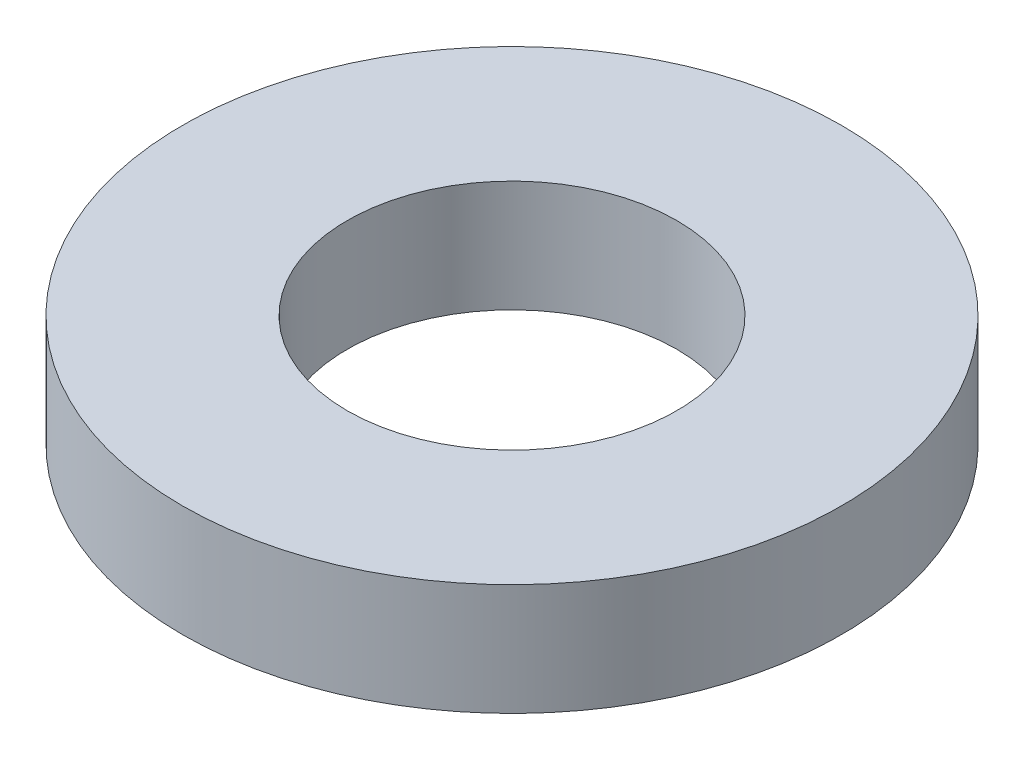
ISO-10303-21;
HEADER;
FILE_DESCRIPTION(('STEP AP214'),'2;1');
FILE_NAME('part.step','',(''),(''),'','','');
FILE_SCHEMA(('AUTOMOTIVE_DESIGN { 1 0 10303 214 1 1 1 1 }'));
ENDSEC;
DATA;
#1=APPLICATION_CONTEXT('core data for automotive mechanical design processes');
#2=APPLICATION_PROTOCOL_DEFINITION('international standard','automotive_design',2000,#1);
#3=PRODUCT_CONTEXT('',#1,'mechanical');
#4=PRODUCT('Part','Part','',(#3));
#5=PRODUCT_RELATED_PRODUCT_CATEGORY('part','',(#4));
#6=PRODUCT_DEFINITION_FORMATION('','',#4);
#7=PRODUCT_DEFINITION_CONTEXT('part definition',#1,'design');
#8=PRODUCT_DEFINITION('design','',#6,#7);
#9=PRODUCT_DEFINITION_SHAPE('','',#8);
#10=(LENGTH_UNIT() NAMED_UNIT(*) SI_UNIT(.MILLI.,.METRE.));
#11=(NAMED_UNIT(*) PLANE_ANGLE_UNIT() SI_UNIT($,.RADIAN.));
#12=(NAMED_UNIT(*) SI_UNIT($,.STERADIAN.) SOLID_ANGLE_UNIT());
#13=UNCERTAINTY_MEASURE_WITH_UNIT(LENGTH_MEASURE(1.E-05),#10,'distance_accuracy_value','');
#14=(GEOMETRIC_REPRESENTATION_CONTEXT(3) GLOBAL_UNCERTAINTY_ASSIGNED_CONTEXT((#13)) GLOBAL_UNIT_ASSIGNED_CONTEXT((#10,
#11,#12)) REPRESENTATION_CONTEXT('',''));
#15=CARTESIAN_POINT('',(0.,0.,0.));
#16=DIRECTION('',(0.,0.,1.));
#17=DIRECTION('',(1.,0.,0.));
#18=AXIS2_PLACEMENT_3D('',#15,#16,#17);
#19=CARTESIAN_POINT('',(0.,22.,0.));
#20=DIRECTION('',(0.,-1.,0.));
#21=DIRECTION('',(0.,0.,-1.));
#22=AXIS2_PLACEMENT_3D('',#19,#20,#21);
#23=CYLINDRICAL_SURFACE('',#22,65.);
#24=CARTESIAN_POINT('',(0.,22.,0.));
#25=DIRECTION('',(0.,1.,0.));
#26=DIRECTION('',(0.,0.,1.));
#27=AXIS2_PLACEMENT_3D('',#24,#25,#26);
#28=CIRCLE('',#27,65.);
#29=CARTESIAN_POINT('',(0.,22.,65.));
#30=VERTEX_POINT('',#29);
#31=EDGE_CURVE('E10',#30,#30,#28,.T.);
#32=ORIENTED_EDGE('',*,*,#31,.F.);
#33=EDGE_LOOP('',(#32));
#34=FACE_BOUND('',#33,.T.);
#35=CARTESIAN_POINT('',(0.,0.,0.));
#36=DIRECTION('',(0.,1.,0.));
#37=DIRECTION('',(0.,0.,1.));
#38=AXIS2_PLACEMENT_3D('',#35,#36,#37);
#39=CIRCLE('',#38,65.);
#40=CARTESIAN_POINT('',(0.,0.,65.));
#41=VERTEX_POINT('',#40);
#42=EDGE_CURVE('E37',#41,#41,#39,.T.);
#43=ORIENTED_EDGE('',*,*,#42,.T.);
#44=EDGE_LOOP('',(#43));
#45=FACE_BOUND('',#44,.T.);
#46=ADVANCED_FACE('F40',(#34,#45),#23,.T.);
#47=CARTESIAN_POINT('',(0.,22.,0.));
#48=DIRECTION('',(0.,1.,0.));
#49=DIRECTION('',(0.,0.,1.));
#50=AXIS2_PLACEMENT_3D('',#47,#48,#49);
#51=PLANE('',#50);
#52=CARTESIAN_POINT('',(0.,22.,0.));
#53=DIRECTION('',(0.,1.,0.));
#54=DIRECTION('',(0.,0.,1.));
#55=AXIS2_PLACEMENT_3D('',#52,#53,#54);
#56=CIRCLE('',#55,32.5);
#57=CARTESIAN_POINT('',(0.,22.,32.5));
#58=VERTEX_POINT('',#57);
#59=EDGE_CURVE('E50',#58,#58,#56,.T.);
#60=ORIENTED_EDGE('',*,*,#59,.F.);
#61=EDGE_LOOP('',(#60));
#62=FACE_BOUND('',#61,.T.);
#63=ORIENTED_EDGE('',*,*,#31,.T.);
#64=EDGE_LOOP('',(#63));
#65=FACE_BOUND('',#64,.T.);
#66=ADVANCED_FACE('F59',(#62,#65),#51,.T.);
#67=CARTESIAN_POINT('',(0.,0.,0.));
#68=DIRECTION('',(0.,1.,0.));
#69=DIRECTION('',(0.,0.,1.));
#70=AXIS2_PLACEMENT_3D('',#67,#68,#69);
#71=PLANE('',#70);
#72=CARTESIAN_POINT('',(0.,0.,0.));
#73=DIRECTION('',(0.,1.,0.));
#74=DIRECTION('',(0.,0.,1.));
#75=AXIS2_PLACEMENT_3D('',#72,#73,#74);
#76=CIRCLE('',#75,32.5);
#77=CARTESIAN_POINT('',(0.,0.,32.5));
#78=VERTEX_POINT('',#77);
#79=EDGE_CURVE('E47',#78,#78,#76,.T.);
#80=ORIENTED_EDGE('',*,*,#79,.T.);
#81=EDGE_LOOP('',(#80));
#82=FACE_BOUND('',#81,.T.);
#83=ORIENTED_EDGE('',*,*,#42,.F.);
#84=EDGE_LOOP('',(#83));
#85=FACE_BOUND('',#84,.T.);
#86=ADVANCED_FACE('F58',(#82,#85),#71,.F.);
#87=CARTESIAN_POINT('',(0.,22.,0.));
#88=DIRECTION('',(0.,-1.,0.));
#89=DIRECTION('',(0.,0.,-1.));
#90=AXIS2_PLACEMENT_3D('',#87,#88,#89);
#91=CYLINDRICAL_SURFACE('',#90,32.5);
#92=ORIENTED_EDGE('',*,*,#59,.T.);
#93=EDGE_LOOP('',(#92));
#94=FACE_BOUND('',#93,.T.);
#95=ORIENTED_EDGE('',*,*,#79,.F.);
#96=EDGE_LOOP('',(#95));
#97=FACE_BOUND('',#96,.T.);
#98=ADVANCED_FACE('F54',(#94,#97),#91,.F.);
#99=CLOSED_SHELL('',(#46,#66,#86,#98));
#100=MANIFOLD_SOLID_BREP('B2',#99);
#101=ADVANCED_BREP_SHAPE_REPRESENTATION('',(#18,#100),#14);
#102=SHAPE_DEFINITION_REPRESENTATION(#9,#101);
ENDSEC;
END-ISO-10303-21;
